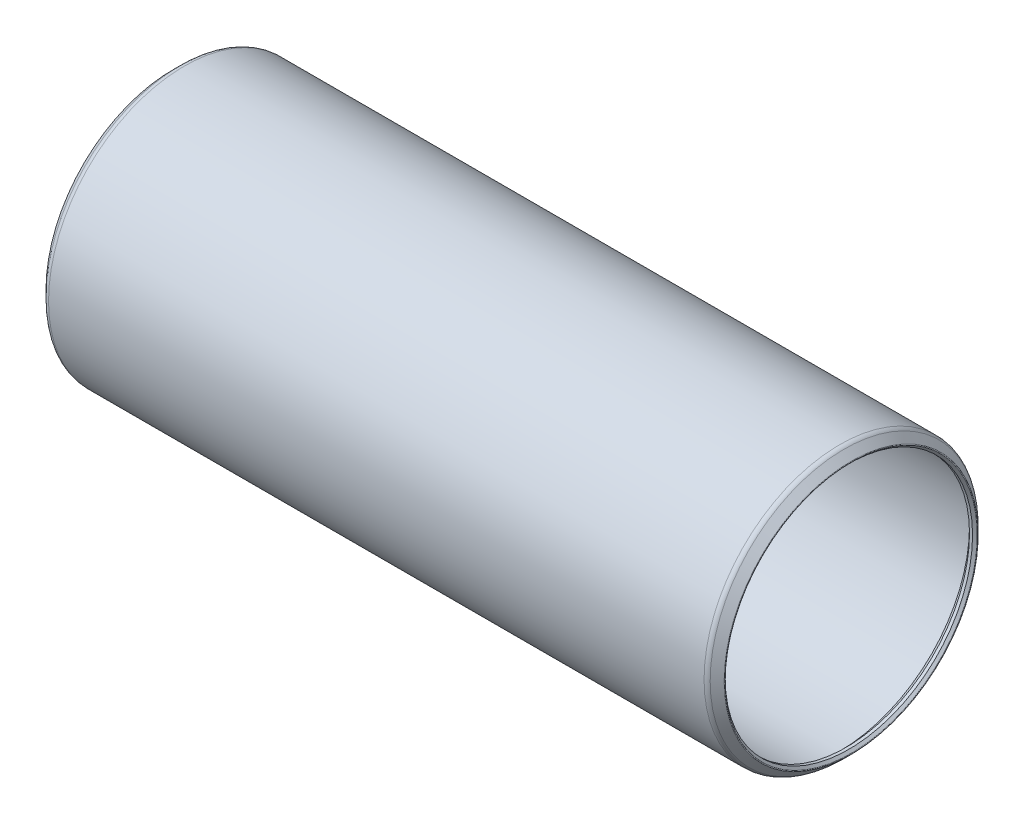
ISO-10303-21;
HEADER;
FILE_DESCRIPTION(('STEP AP214'),'2;1');
FILE_NAME('part.step','',(''),(''),'','','');
FILE_SCHEMA(('AUTOMOTIVE_DESIGN { 1 0 10303 214 1 1 1 1 }'));
ENDSEC;
DATA;
#1=APPLICATION_CONTEXT('core data for automotive mechanical design processes');
#2=APPLICATION_PROTOCOL_DEFINITION('international standard','automotive_design',2000,#1);
#3=PRODUCT_CONTEXT('',#1,'mechanical');
#4=PRODUCT('Part','Part','',(#3));
#5=PRODUCT_RELATED_PRODUCT_CATEGORY('part','',(#4));
#6=PRODUCT_DEFINITION_FORMATION('','',#4);
#7=PRODUCT_DEFINITION_CONTEXT('part definition',#1,'design');
#8=PRODUCT_DEFINITION('design','',#6,#7);
#9=PRODUCT_DEFINITION_SHAPE('','',#8);
#10=(LENGTH_UNIT() NAMED_UNIT(*) SI_UNIT(.MILLI.,.METRE.));
#11=(NAMED_UNIT(*) PLANE_ANGLE_UNIT() SI_UNIT($,.RADIAN.));
#12=(NAMED_UNIT(*) SI_UNIT($,.STERADIAN.) SOLID_ANGLE_UNIT());
#13=UNCERTAINTY_MEASURE_WITH_UNIT(LENGTH_MEASURE(1.E-05),#10,'distance_accuracy_value','');
#14=(GEOMETRIC_REPRESENTATION_CONTEXT(3) GLOBAL_UNCERTAINTY_ASSIGNED_CONTEXT((#13)) GLOBAL_UNIT_ASSIGNED_CONTEXT((#10,
#11,#12)) REPRESENTATION_CONTEXT('',''));
#15=CARTESIAN_POINT('',(0.,0.,0.));
#16=DIRECTION('',(0.,0.,1.));
#17=DIRECTION('',(1.,0.,0.));
#18=AXIS2_PLACEMENT_3D('',#15,#16,#17);
#19=CARTESIAN_POINT('',(-0.829281135627834,0.,0.));
#20=DIRECTION('',(-1.,0.,0.));
#21=DIRECTION('',(0.,0.,1.));
#22=AXIS2_PLACEMENT_3D('',#19,#20,#21);
#23=TOROIDAL_SURFACE('',#22,21.8241862580485,0.126999999999527);
#24=CARTESIAN_POINT('',(-0.919083696838047,0.,0.));
#25=DIRECTION('',(-1.,0.,0.));
#26=DIRECTION('',(0.,0.,1.));
#27=AXIS2_PLACEMENT_3D('',#24,#25,#26);
#28=CIRCLE('',#27,21.734383696838);
#29=CARTESIAN_POINT('',(-0.919083696838047,0.,21.734383696838));
#30=VERTEX_POINT('',#29);
#31=EDGE_CURVE('E10',#30,#30,#28,.T.);
#32=ORIENTED_EDGE('',*,*,#31,.F.);
#33=EDGE_LOOP('',(#32));
#34=FACE_BOUND('',#33,.T.);
#35=CARTESIAN_POINT('',(-0.919083696838047,0.,0.));
#36=DIRECTION('',(-1.,0.,0.));
#37=DIRECTION('',(0.,0.,1.));
#38=AXIS2_PLACEMENT_3D('',#35,#36,#37);
#39=CIRCLE('',#38,21.913988819259);
#40=CARTESIAN_POINT('',(-0.919083696838047,0.,21.913988819259));
#41=VERTEX_POINT('',#40);
#42=EDGE_CURVE('E78',#41,#41,#39,.T.);
#43=ORIENTED_EDGE('',*,*,#42,.T.);
#44=EDGE_LOOP('',(#43));
#45=FACE_BOUND('',#44,.T.);
#46=ADVANCED_FACE('F32',(#34,#45),#23,.T.);
#47=CARTESIAN_POINT('',(-0.919083696838047,0.,0.));
#48=DIRECTION('',(-1.,0.,0.));
#49=DIRECTION('',(0.,0.,1.));
#50=AXIS2_PLACEMENT_3D('',#47,#48,#49);
#51=CONICAL_SURFACE('',#50,21.734383696838,0.785398163397395);
#52=CARTESIAN_POINT('',(-0.527050000000001,0.,0.));
#53=DIRECTION('',(-1.,0.,0.));
#54=DIRECTION('',(0.,0.,1.));
#55=AXIS2_PLACEMENT_3D('',#52,#53,#54);
#56=CIRCLE('',#55,21.34235);
#57=CARTESIAN_POINT('',(-0.527050000000001,0.,21.34235));
#58=VERTEX_POINT('',#57);
#59=EDGE_CURVE('E38',#58,#58,#56,.T.);
#60=ORIENTED_EDGE('',*,*,#59,.F.);
#61=EDGE_LOOP('',(#60));
#62=FACE_BOUND('',#61,.T.);
#63=ORIENTED_EDGE('',*,*,#31,.T.);
#64=EDGE_LOOP('',(#63));
#65=FACE_BOUND('',#64,.T.);
#66=ADVANCED_FACE('F151',(#62,#65),#51,.F.);
#67=CARTESIAN_POINT('',(115.1509,0.,0.));
#68=DIRECTION('',(-1.,0.,0.));
#69=DIRECTION('',(0.,0.,1.));
#70=AXIS2_PLACEMENT_3D('',#67,#68,#69);
#71=CYLINDRICAL_SURFACE('',#70,21.34235);
#72=CARTESIAN_POINT('',(0.,0.,0.));
#73=DIRECTION('',(-1.,0.,0.));
#74=DIRECTION('',(0.,0.,1.));
#75=AXIS2_PLACEMENT_3D('',#72,#73,#74);
#76=CIRCLE('',#75,21.34235);
#77=CARTESIAN_POINT('',(0.,0.,21.34235));
#78=VERTEX_POINT('',#77);
#79=EDGE_CURVE('E42',#78,#78,#76,.T.);
#80=ORIENTED_EDGE('',*,*,#79,.F.);
#81=EDGE_LOOP('',(#80));
#82=FACE_BOUND('',#81,.T.);
#83=ORIENTED_EDGE('',*,*,#59,.T.);
#84=EDGE_LOOP('',(#83));
#85=FACE_BOUND('',#84,.T.);
#86=ADVANCED_FACE('F146',(#82,#85),#71,.F.);
#87=CARTESIAN_POINT('',(0.,0.,0.));
#88=DIRECTION('',(1.,0.,0.));
#89=DIRECTION('',(0.,0.,-1.));
#90=AXIS2_PLACEMENT_3D('',#87,#88,#89);
#91=CONICAL_SURFACE('',#90,21.34235,0.785398163397448);
#92=CARTESIAN_POINT('',(1.0541,0.,0.));
#93=DIRECTION('',(-1.,0.,0.));
#94=DIRECTION('',(0.,0.,1.));
#95=AXIS2_PLACEMENT_3D('',#92,#93,#94);
#96=CIRCLE('',#95,22.39645);
#97=CARTESIAN_POINT('',(1.0541,0.,22.39645));
#98=VERTEX_POINT('',#97);
#99=EDGE_CURVE('E46',#98,#98,#96,.T.);
#100=ORIENTED_EDGE('',*,*,#99,.F.);
#101=EDGE_LOOP('',(#100));
#102=FACE_BOUND('',#101,.T.);
#103=ORIENTED_EDGE('',*,*,#79,.T.);
#104=EDGE_LOOP('',(#103));
#105=FACE_BOUND('',#104,.T.);
#106=ADVANCED_FACE('F140',(#102,#105),#91,.F.);
#107=CARTESIAN_POINT('',(115.1509,0.,0.));
#108=DIRECTION('',(-1.,0.,0.));
#109=DIRECTION('',(0.,0.,1.));
#110=AXIS2_PLACEMENT_3D('',#107,#108,#109);
#111=CYLINDRICAL_SURFACE('',#110,22.39645);
#112=CARTESIAN_POINT('',(114.0968,0.,0.));
#113=DIRECTION('',(-1.,0.,0.));
#114=DIRECTION('',(0.,0.,1.));
#115=AXIS2_PLACEMENT_3D('',#112,#113,#114);
#116=CIRCLE('',#115,22.39645);
#117=CARTESIAN_POINT('',(114.0968,0.,22.39645));
#118=VERTEX_POINT('',#117);
#119=EDGE_CURVE('E51',#118,#118,#116,.T.);
#120=ORIENTED_EDGE('',*,*,#119,.F.);
#121=EDGE_LOOP('',(#120));
#122=FACE_BOUND('',#121,.T.);
#123=ORIENTED_EDGE('',*,*,#99,.T.);
#124=EDGE_LOOP('',(#123));
#125=FACE_BOUND('',#124,.T.);
#126=ADVANCED_FACE('F134',(#122,#125),#111,.F.);
#127=CARTESIAN_POINT('',(114.0968,0.,0.));
#128=DIRECTION('',(-1.,0.,0.));
#129=DIRECTION('',(0.,0.,1.));
#130=AXIS2_PLACEMENT_3D('',#127,#128,#129);
#131=CONICAL_SURFACE('',#130,22.39645,0.785398163397448);
#132=CARTESIAN_POINT('',(115.1509,0.,0.));
#133=DIRECTION('',(-1.,0.,0.));
#134=DIRECTION('',(0.,0.,1.));
#135=AXIS2_PLACEMENT_3D('',#132,#133,#134);
#136=CIRCLE('',#135,21.34235);
#137=CARTESIAN_POINT('',(115.1509,0.,21.34235));
#138=VERTEX_POINT('',#137);
#139=EDGE_CURVE('E54',#138,#138,#136,.T.);
#140=ORIENTED_EDGE('',*,*,#139,.F.);
#141=EDGE_LOOP('',(#140));
#142=FACE_BOUND('',#141,.T.);
#143=ORIENTED_EDGE('',*,*,#119,.T.);
#144=EDGE_LOOP('',(#143));
#145=FACE_BOUND('',#144,.T.);
#146=ADVANCED_FACE('F128',(#142,#145),#131,.F.);
#147=CARTESIAN_POINT('',(115.1509,0.,0.));
#148=DIRECTION('',(-1.,0.,0.));
#149=DIRECTION('',(0.,0.,1.));
#150=AXIS2_PLACEMENT_3D('',#147,#148,#149);
#151=CYLINDRICAL_SURFACE('',#150,21.34235);
#152=CARTESIAN_POINT('',(115.67795,0.,0.));
#153=DIRECTION('',(-1.,0.,0.));
#154=DIRECTION('',(0.,0.,1.));
#155=AXIS2_PLACEMENT_3D('',#152,#153,#154);
#156=CIRCLE('',#155,21.34235);
#157=CARTESIAN_POINT('',(115.67795,0.,21.34235));
#158=VERTEX_POINT('',#157);
#159=EDGE_CURVE('E57',#158,#158,#156,.T.);
#160=ORIENTED_EDGE('',*,*,#159,.F.);
#161=EDGE_LOOP('',(#160));
#162=FACE_BOUND('',#161,.T.);
#163=ORIENTED_EDGE('',*,*,#139,.T.);
#164=EDGE_LOOP('',(#163));
#165=FACE_BOUND('',#164,.T.);
#166=ADVANCED_FACE('F122',(#162,#165),#151,.F.);
#167=CARTESIAN_POINT('',(115.67795,0.,0.));
#168=DIRECTION('',(1.,0.,0.));
#169=DIRECTION('',(0.,0.,-1.));
#170=AXIS2_PLACEMENT_3D('',#167,#168,#169);
#171=CONICAL_SURFACE('',#170,21.34235,0.785398163397245);
#172=CARTESIAN_POINT('',(116.06998369684,0.,0.));
#173=DIRECTION('',(-1.,0.,0.));
#174=DIRECTION('',(0.,0.,1.));
#175=AXIS2_PLACEMENT_3D('',#172,#173,#174);
#176=CIRCLE('',#175,21.73438369684);
#177=CARTESIAN_POINT('',(116.06998369684,0.,21.73438369684));
#178=VERTEX_POINT('',#177);
#179=EDGE_CURVE('E60',#178,#178,#176,.T.);
#180=ORIENTED_EDGE('',*,*,#179,.F.);
#181=EDGE_LOOP('',(#180));
#182=FACE_BOUND('',#181,.T.);
#183=ORIENTED_EDGE('',*,*,#159,.T.);
#184=EDGE_LOOP('',(#183));
#185=FACE_BOUND('',#184,.T.);
#186=ADVANCED_FACE('F116',(#182,#185),#171,.F.);
#187=CARTESIAN_POINT('',(115.980181135631,0.,0.));
#188=DIRECTION('',(-1.,0.,0.));
#189=DIRECTION('',(0.,0.,1.));
#190=AXIS2_PLACEMENT_3D('',#187,#188,#189);
#191=TOROIDAL_SURFACE('',#190,21.8241862580493,0.126999999997993);
#192=CARTESIAN_POINT('',(116.06998369684,0.,0.));
#193=DIRECTION('',(-1.,0.,0.));
#194=DIRECTION('',(0.,0.,1.));
#195=AXIS2_PLACEMENT_3D('',#192,#193,#194);
#196=CIRCLE('',#195,21.913988819259);
#197=CARTESIAN_POINT('',(116.06998369684,0.,21.913988819259));
#198=VERTEX_POINT('',#197);
#199=EDGE_CURVE('E63',#198,#198,#196,.T.);
#200=ORIENTED_EDGE('',*,*,#199,.F.);
#201=EDGE_LOOP('',(#200));
#202=FACE_BOUND('',#201,.T.);
#203=ORIENTED_EDGE('',*,*,#179,.T.);
#204=EDGE_LOOP('',(#203));
#205=FACE_BOUND('',#204,.T.);
#206=ADVANCED_FACE('F110',(#202,#205),#191,.T.);
#207=CARTESIAN_POINT('',(116.06998369684,0.,0.));
#208=DIRECTION('',(-1.,0.,0.));
#209=DIRECTION('',(0.,0.,1.));
#210=AXIS2_PLACEMENT_3D('',#207,#208,#209);
#211=CONICAL_SURFACE('',#210,21.913988819259,0.78539816339728);
#212=CARTESIAN_POINT('',(114.867561258047,0.,0.));
#213=DIRECTION('',(-1.,0.,0.));
#214=DIRECTION('',(0.,0.,1.));
#215=AXIS2_PLACEMENT_3D('',#212,#213,#214);
#216=CIRCLE('',#215,23.1164112580512);
#217=CARTESIAN_POINT('',(114.867561258047,0.,23.1164112580512));
#218=VERTEX_POINT('',#217);
#219=EDGE_CURVE('E66',#218,#218,#216,.T.);
#220=ORIENTED_EDGE('',*,*,#219,.F.);
#221=EDGE_LOOP('',(#220));
#222=FACE_BOUND('',#221,.T.);
#223=ORIENTED_EDGE('',*,*,#199,.T.);
#224=EDGE_LOOP('',(#223));
#225=FACE_BOUND('',#224,.T.);
#226=ADVANCED_FACE('F104',(#222,#225),#211,.T.);
#227=CARTESIAN_POINT('',(114.122200000006,0.,0.));
#228=DIRECTION('',(-1.,0.,0.));
#229=DIRECTION('',(0.,0.,1.));
#230=AXIS2_PLACEMENT_3D('',#227,#228,#229);
#231=TOROIDAL_SURFACE('',#230,22.3710500000097,1.05409999999005);
#232=CARTESIAN_POINT('',(114.122200000006,0.,0.));
#233=DIRECTION('',(-1.,0.,0.));
#234=DIRECTION('',(0.,0.,1.));
#235=AXIS2_PLACEMENT_3D('',#232,#233,#234);
#236=CIRCLE('',#235,23.4251499999997);
#237=CARTESIAN_POINT('',(114.122200000006,0.,23.4251499999997));
#238=VERTEX_POINT('',#237);
#239=EDGE_CURVE('E69',#238,#238,#236,.T.);
#240=ORIENTED_EDGE('',*,*,#239,.F.);
#241=EDGE_LOOP('',(#240));
#242=FACE_BOUND('',#241,.T.);
#243=ORIENTED_EDGE('',*,*,#219,.T.);
#244=EDGE_LOOP('',(#243));
#245=FACE_BOUND('',#244,.T.);
#246=ADVANCED_FACE('F98',(#242,#245),#231,.T.);
#247=CARTESIAN_POINT('',(115.1509,0.,0.));
#248=DIRECTION('',(-1.,0.,0.));
#249=DIRECTION('',(0.,0.,1.));
#250=AXIS2_PLACEMENT_3D('',#247,#248,#249);
#251=CYLINDRICAL_SURFACE('',#250,23.4251499999997);
#252=CARTESIAN_POINT('',(1.02869999999999,0.,0.));
#253=DIRECTION('',(-1.,0.,0.));
#254=DIRECTION('',(0.,0.,1.));
#255=AXIS2_PLACEMENT_3D('',#252,#253,#254);
#256=CIRCLE('',#255,23.4251499999998);
#257=CARTESIAN_POINT('',(1.02869999999999,0.,23.4251499999998));
#258=VERTEX_POINT('',#257);
#259=EDGE_CURVE('E72',#258,#258,#256,.T.);
#260=ORIENTED_EDGE('',*,*,#259,.F.);
#261=EDGE_LOOP('',(#260));
#262=FACE_BOUND('',#261,.T.);
#263=ORIENTED_EDGE('',*,*,#239,.T.);
#264=EDGE_LOOP('',(#263));
#265=FACE_BOUND('',#264,.T.);
#266=ADVANCED_FACE('F92',(#262,#265),#251,.T.);
#267=CARTESIAN_POINT('',(1.0287000000009,0.,0.));
#268=DIRECTION('',(-1.,0.,0.));
#269=DIRECTION('',(0.,0.,1.));
#270=AXIS2_PLACEMENT_3D('',#267,#268,#269);
#271=TOROIDAL_SURFACE('',#270,22.3710499999972,1.05410000000257);
#272=CARTESIAN_POINT('',(0.283338741950523,0.,0.));
#273=DIRECTION('',(-1.,0.,0.));
#274=DIRECTION('',(0.,0.,1.));
#275=AXIS2_PLACEMENT_3D('',#272,#273,#274);
#276=CIRCLE('',#275,23.1164112580476);
#277=CARTESIAN_POINT('',(0.283338741950523,0.,23.1164112580476));
#278=VERTEX_POINT('',#277);
#279=EDGE_CURVE('E75',#278,#278,#276,.T.);
#280=ORIENTED_EDGE('',*,*,#279,.F.);
#281=EDGE_LOOP('',(#280));
#282=FACE_BOUND('',#281,.T.);
#283=ORIENTED_EDGE('',*,*,#259,.T.);
#284=EDGE_LOOP('',(#283));
#285=FACE_BOUND('',#284,.T.);
#286=ADVANCED_FACE('F86',(#282,#285),#271,.T.);
#287=CARTESIAN_POINT('',(0.283338741950523,0.,0.));
#288=DIRECTION('',(1.,0.,0.));
#289=DIRECTION('',(0.,0.,-1.));
#290=AXIS2_PLACEMENT_3D('',#287,#288,#289);
#291=CONICAL_SURFACE('',#290,23.1164112580476,0.78539816339745);
#292=ORIENTED_EDGE('',*,*,#42,.F.);
#293=EDGE_LOOP('',(#292));
#294=FACE_BOUND('',#293,.T.);
#295=ORIENTED_EDGE('',*,*,#279,.T.);
#296=EDGE_LOOP('',(#295));
#297=FACE_BOUND('',#296,.T.);
#298=ADVANCED_FACE('F83',(#294,#297),#291,.T.);
#299=CLOSED_SHELL('',(#46,#66,#86,#106,#126,#146,#166,#186,#206,#226,#246,#266,#286,#298));
#300=MANIFOLD_SOLID_BREP('B2',#299);
#301=ADVANCED_BREP_SHAPE_REPRESENTATION('',(#18,#300),#14);
#302=SHAPE_DEFINITION_REPRESENTATION(#9,#301);
ENDSEC;
END-ISO-10303-21;
